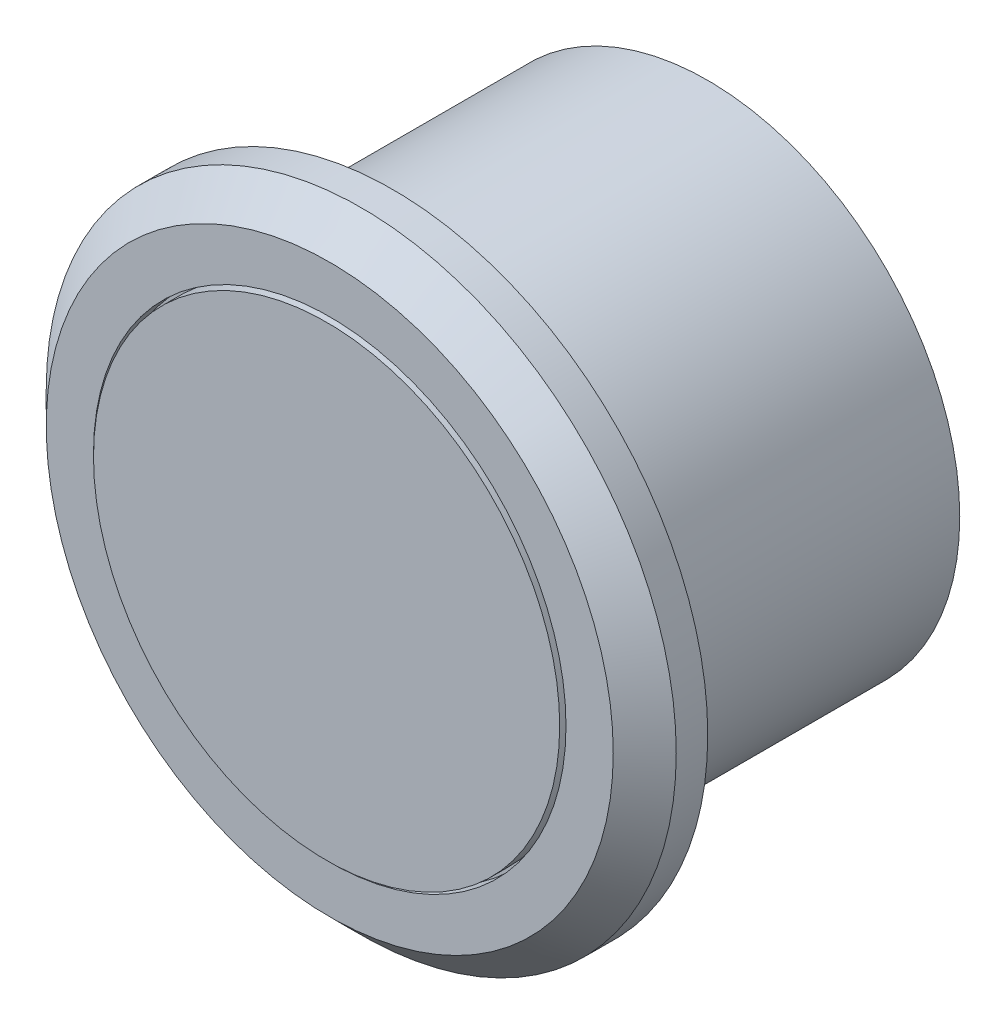
ISO-10303-21;
HEADER;
FILE_DESCRIPTION(('STEP AP214'),'2;1');
FILE_NAME('part.step','',(''),(''),'','','');
FILE_SCHEMA(('AUTOMOTIVE_DESIGN { 1 0 10303 214 1 1 1 1 }'));
ENDSEC;
DATA;
#1=APPLICATION_CONTEXT('core data for automotive mechanical design processes');
#2=APPLICATION_PROTOCOL_DEFINITION('international standard','automotive_design',2000,#1);
#3=PRODUCT_CONTEXT('',#1,'mechanical');
#4=PRODUCT('Part','Part','',(#3));
#5=PRODUCT_RELATED_PRODUCT_CATEGORY('part','',(#4));
#6=PRODUCT_DEFINITION_FORMATION('','',#4);
#7=PRODUCT_DEFINITION_CONTEXT('part definition',#1,'design');
#8=PRODUCT_DEFINITION('design','',#6,#7);
#9=PRODUCT_DEFINITION_SHAPE('','',#8);
#10=(LENGTH_UNIT() NAMED_UNIT(*) SI_UNIT(.MILLI.,.METRE.));
#11=(NAMED_UNIT(*) PLANE_ANGLE_UNIT() SI_UNIT($,.RADIAN.));
#12=(NAMED_UNIT(*) SI_UNIT($,.STERADIAN.) SOLID_ANGLE_UNIT());
#13=UNCERTAINTY_MEASURE_WITH_UNIT(LENGTH_MEASURE(1.E-05),#10,'distance_accuracy_value','');
#14=(GEOMETRIC_REPRESENTATION_CONTEXT(3) GLOBAL_UNCERTAINTY_ASSIGNED_CONTEXT((#13)) GLOBAL_UNIT_ASSIGNED_CONTEXT((#10,
#11,#12)) REPRESENTATION_CONTEXT('',''));
#15=CARTESIAN_POINT('',(0.,0.,0.));
#16=DIRECTION('',(0.,0.,1.));
#17=DIRECTION('',(1.,0.,0.));
#18=AXIS2_PLACEMENT_3D('',#15,#16,#17);
#19=CARTESIAN_POINT('',(0.,0.,10.));
#20=DIRECTION('',(0.,0.,-1.));
#21=DIRECTION('',(-1.,0.,0.));
#22=AXIS2_PLACEMENT_3D('',#19,#20,#21);
#23=CYLINDRICAL_SURFACE('',#22,8.);
#24=CARTESIAN_POINT('',(0.,0.,10.));
#25=DIRECTION('',(0.,0.,1.));
#26=DIRECTION('',(1.,0.,0.));
#27=AXIS2_PLACEMENT_3D('',#24,#25,#26);
#28=CIRCLE('',#27,8.);
#29=CARTESIAN_POINT('',(8.,0.,10.));
#30=VERTEX_POINT('',#29);
#31=EDGE_CURVE('E44',#30,#30,#28,.T.);
#32=ORIENTED_EDGE('',*,*,#31,.F.);
#33=EDGE_LOOP('',(#32));
#34=FACE_BOUND('',#33,.T.);
#35=CARTESIAN_POINT('',(0.,0.,0.));
#36=DIRECTION('',(0.,0.,1.));
#37=DIRECTION('',(1.,0.,0.));
#38=AXIS2_PLACEMENT_3D('',#35,#36,#37);
#39=CIRCLE('',#38,8.);
#40=CARTESIAN_POINT('',(8.,0.,0.));
#41=VERTEX_POINT('',#40);
#42=EDGE_CURVE('E48',#41,#41,#39,.T.);
#43=ORIENTED_EDGE('',*,*,#42,.T.);
#44=EDGE_LOOP('',(#43));
#45=FACE_BOUND('',#44,.T.);
#46=ADVANCED_FACE('F33',(#34,#45),#23,.T.);
#47=CARTESIAN_POINT('',(0.,0.,0.));
#48=DIRECTION('',(0.,0.,1.));
#49=DIRECTION('',(1.,0.,0.));
#50=AXIS2_PLACEMENT_3D('',#47,#48,#49);
#51=PLANE('',#50);
#52=ORIENTED_EDGE('',*,*,#42,.F.);
#53=EDGE_LOOP('',(#52));
#54=FACE_BOUND('',#53,.T.);
#55=ADVANCED_FACE('F100',(#54),#51,.F.);
#56=CARTESIAN_POINT('',(0.,0.,12.));
#57=DIRECTION('',(0.,0.,-1.));
#58=DIRECTION('',(-1.,0.,0.));
#59=AXIS2_PLACEMENT_3D('',#56,#57,#58);
#60=CYLINDRICAL_SURFACE('',#59,10.);
#61=CARTESIAN_POINT('',(0.,0.,11.));
#62=DIRECTION('',(0.,0.,1.));
#63=DIRECTION('',(1.,0.,0.));
#64=AXIS2_PLACEMENT_3D('',#61,#62,#63);
#65=CIRCLE('',#64,10.);
#66=CARTESIAN_POINT('',(10.,0.,11.));
#67=VERTEX_POINT('',#66);
#68=EDGE_CURVE('E10',#67,#67,#65,.F.);
#69=ORIENTED_EDGE('',*,*,#68,.T.);
#70=EDGE_LOOP('',(#69));
#71=FACE_BOUND('',#70,.T.);
#72=CARTESIAN_POINT('',(0.,0.,10.));
#73=DIRECTION('',(0.,0.,1.));
#74=DIRECTION('',(1.,0.,0.));
#75=AXIS2_PLACEMENT_3D('',#72,#73,#74);
#76=CIRCLE('',#75,10.);
#77=CARTESIAN_POINT('',(10.,0.,10.));
#78=VERTEX_POINT('',#77);
#79=EDGE_CURVE('E52',#78,#78,#76,.T.);
#80=ORIENTED_EDGE('',*,*,#79,.T.);
#81=EDGE_LOOP('',(#80));
#82=FACE_BOUND('',#81,.T.);
#83=ADVANCED_FACE('F92',(#71,#82),#60,.T.);
#84=CARTESIAN_POINT('',(0.,0.,12.));
#85=DIRECTION('',(0.,0.,1.));
#86=DIRECTION('',(1.,0.,0.));
#87=AXIS2_PLACEMENT_3D('',#84,#85,#86);
#88=PLANE('',#87);
#89=CARTESIAN_POINT('',(0.,0.,12.));
#90=DIRECTION('',(0.,0.,1.));
#91=DIRECTION('',(1.,0.,0.));
#92=AXIS2_PLACEMENT_3D('',#89,#90,#91);
#93=CIRCLE('',#92,7.5);
#94=CARTESIAN_POINT('',(7.5,0.,12.));
#95=VERTEX_POINT('',#94);
#96=EDGE_CURVE('E57',#95,#95,#93,.T.);
#97=ORIENTED_EDGE('',*,*,#96,.F.);
#98=EDGE_LOOP('',(#97));
#99=FACE_BOUND('',#98,.T.);
#100=CARTESIAN_POINT('',(0.,0.,12.));
#101=DIRECTION('',(0.,0.,1.));
#102=DIRECTION('',(1.,0.,0.));
#103=AXIS2_PLACEMENT_3D('',#100,#101,#102);
#104=CIRCLE('',#103,9.);
#105=CARTESIAN_POINT('',(9.,0.,12.));
#106=VERTEX_POINT('',#105);
#107=EDGE_CURVE('E40',#106,#106,#104,.T.);
#108=ORIENTED_EDGE('',*,*,#107,.T.);
#109=EDGE_LOOP('',(#108));
#110=FACE_BOUND('',#109,.T.);
#111=ADVANCED_FACE('F89',(#99,#110),#88,.T.);
#112=CARTESIAN_POINT('',(0.,0.,10.));
#113=DIRECTION('',(0.,0.,1.));
#114=DIRECTION('',(1.,0.,0.));
#115=AXIS2_PLACEMENT_3D('',#112,#113,#114);
#116=PLANE('',#115);
#117=ORIENTED_EDGE('',*,*,#31,.T.);
#118=EDGE_LOOP('',(#117));
#119=FACE_BOUND('',#118,.T.);
#120=ORIENTED_EDGE('',*,*,#79,.F.);
#121=EDGE_LOOP('',(#120));
#122=FACE_BOUND('',#121,.T.);
#123=ADVANCED_FACE('F91',(#119,#122),#116,.F.);
#124=CARTESIAN_POINT('',(0.,0.,12.));
#125=DIRECTION('',(0.,0.,-1.));
#126=DIRECTION('',(-1.,0.,0.));
#127=AXIS2_PLACEMENT_3D('',#124,#125,#126);
#128=CONICAL_SURFACE('',#127,9.,0.785398163397447);
#129=ORIENTED_EDGE('',*,*,#68,.F.);
#130=EDGE_LOOP('',(#129));
#131=FACE_BOUND('',#130,.T.);
#132=ORIENTED_EDGE('',*,*,#107,.F.);
#133=EDGE_LOOP('',(#132));
#134=FACE_BOUND('',#133,.T.);
#135=ADVANCED_FACE('F35',(#131,#134),#128,.T.);
#136=CARTESIAN_POINT('',(0.,0.,11.5));
#137=DIRECTION('',(0.,0.,1.));
#138=DIRECTION('',(1.,0.,0.));
#139=AXIS2_PLACEMENT_3D('',#136,#137,#138);
#140=CYLINDRICAL_SURFACE('',#139,7.5);
#141=CARTESIAN_POINT('',(0.,0.,11.5));
#142=DIRECTION('',(0.,0.,1.));
#143=DIRECTION('',(1.,0.,0.));
#144=AXIS2_PLACEMENT_3D('',#141,#142,#143);
#145=CIRCLE('',#144,7.5);
#146=CARTESIAN_POINT('',(7.5,0.,11.5));
#147=VERTEX_POINT('',#146);
#148=EDGE_CURVE('E56',#147,#147,#145,.T.);
#149=ORIENTED_EDGE('',*,*,#148,.F.);
#150=EDGE_LOOP('',(#149));
#151=FACE_BOUND('',#150,.T.);
#152=ORIENTED_EDGE('',*,*,#96,.T.);
#153=EDGE_LOOP('',(#152));
#154=FACE_BOUND('',#153,.T.);
#155=ADVANCED_FACE('F80',(#151,#154),#140,.F.);
#156=CARTESIAN_POINT('',(0.,0.,11.5));
#157=DIRECTION('',(0.,0.,1.));
#158=DIRECTION('',(1.,0.,0.));
#159=AXIS2_PLACEMENT_3D('',#156,#157,#158);
#160=PLANE('',#159);
#161=CARTESIAN_POINT('',(0.,0.,11.5));
#162=DIRECTION('',(0.,0.,1.));
#163=DIRECTION('',(1.,0.,0.));
#164=AXIS2_PLACEMENT_3D('',#161,#162,#163);
#165=CIRCLE('',#164,7.4);
#166=CARTESIAN_POINT('',(7.4,0.,11.5));
#167=VERTEX_POINT('',#166);
#168=EDGE_CURVE('E63',#167,#167,#165,.T.);
#169=ORIENTED_EDGE('',*,*,#168,.F.);
#170=EDGE_LOOP('',(#169));
#171=FACE_BOUND('',#170,.T.);
#172=ORIENTED_EDGE('',*,*,#148,.T.);
#173=EDGE_LOOP('',(#172));
#174=FACE_BOUND('',#173,.T.);
#175=ADVANCED_FACE('F74',(#171,#174),#160,.T.);
#176=CARTESIAN_POINT('',(0.,0.,12.1));
#177=DIRECTION('',(0.,0.,-1.));
#178=DIRECTION('',(-1.,0.,0.));
#179=AXIS2_PLACEMENT_3D('',#176,#177,#178);
#180=CYLINDRICAL_SURFACE('',#179,7.4);
#181=CARTESIAN_POINT('',(0.,0.,12.1));
#182=DIRECTION('',(0.,0.,1.));
#183=DIRECTION('',(1.,0.,0.));
#184=AXIS2_PLACEMENT_3D('',#181,#182,#183);
#185=CIRCLE('',#184,7.4);
#186=CARTESIAN_POINT('',(7.4,0.,12.1));
#187=VERTEX_POINT('',#186);
#188=EDGE_CURVE('E60',#187,#187,#185,.T.);
#189=ORIENTED_EDGE('',*,*,#188,.F.);
#190=EDGE_LOOP('',(#189));
#191=FACE_BOUND('',#190,.T.);
#192=ORIENTED_EDGE('',*,*,#168,.T.);
#193=EDGE_LOOP('',(#192));
#194=FACE_BOUND('',#193,.T.);
#195=ADVANCED_FACE('F71',(#191,#194),#180,.T.);
#196=CARTESIAN_POINT('',(0.,0.,12.1));
#197=DIRECTION('',(0.,0.,1.));
#198=DIRECTION('',(1.,0.,0.));
#199=AXIS2_PLACEMENT_3D('',#196,#197,#198);
#200=PLANE('',#199);
#201=ORIENTED_EDGE('',*,*,#188,.T.);
#202=EDGE_LOOP('',(#201));
#203=FACE_BOUND('',#202,.T.);
#204=ADVANCED_FACE('F69',(#203),#200,.T.);
#205=CLOSED_SHELL('',(#46,#55,#83,#111,#123,#135,#155,#175,#195,#204));
#206=MANIFOLD_SOLID_BREP('B2',#205);
#207=ADVANCED_BREP_SHAPE_REPRESENTATION('',(#18,#206),#14);
#208=SHAPE_DEFINITION_REPRESENTATION(#9,#207);
ENDSEC;
END-ISO-10303-21;
